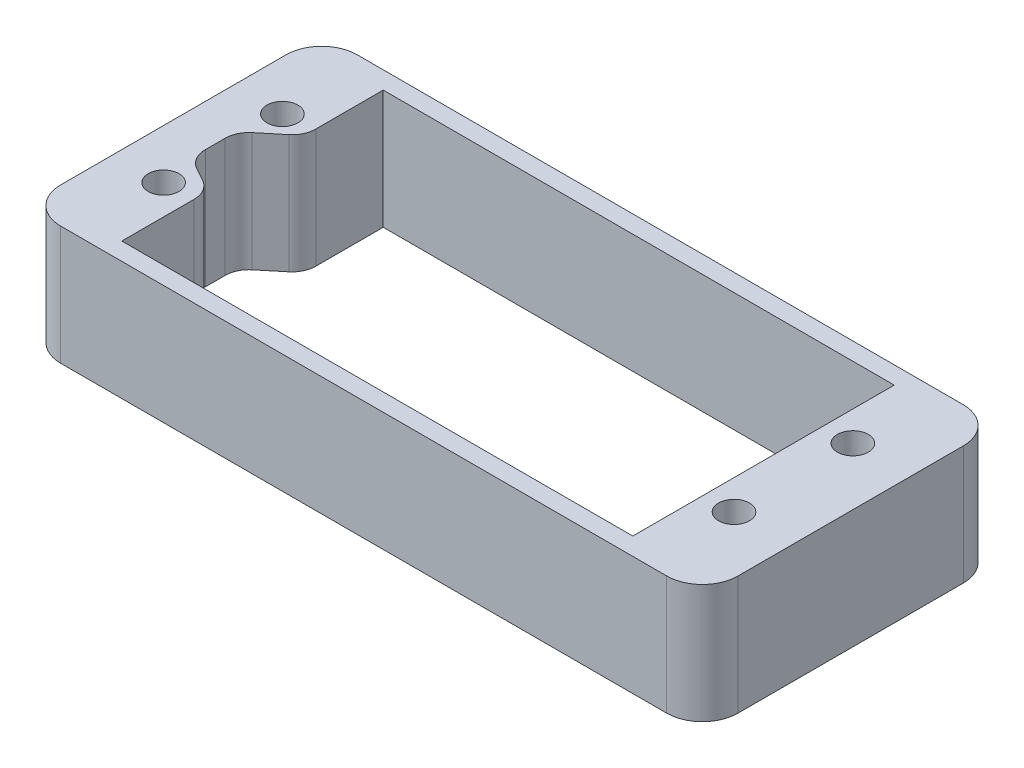
ISO-10303-21;
HEADER;
FILE_DESCRIPTION(('STEP AP214'),'2;1');
FILE_NAME('part.step','',(''),(''),'','','');
FILE_SCHEMA(('AUTOMOTIVE_DESIGN { 1 0 10303 214 1 1 1 1 }'));
ENDSEC;
DATA;
#1=APPLICATION_CONTEXT('core data for automotive mechanical design processes');
#2=APPLICATION_PROTOCOL_DEFINITION('international standard','automotive_design',2000,#1);
#3=PRODUCT_CONTEXT('',#1,'mechanical');
#4=PRODUCT('Part','Part','',(#3));
#5=PRODUCT_RELATED_PRODUCT_CATEGORY('part','',(#4));
#6=PRODUCT_DEFINITION_FORMATION('','',#4);
#7=PRODUCT_DEFINITION_CONTEXT('part definition',#1,'design');
#8=PRODUCT_DEFINITION('design','',#6,#7);
#9=PRODUCT_DEFINITION_SHAPE('','',#8);
#10=(LENGTH_UNIT() NAMED_UNIT(*) SI_UNIT(.MILLI.,.METRE.));
#11=(NAMED_UNIT(*) PLANE_ANGLE_UNIT() SI_UNIT($,.RADIAN.));
#12=(NAMED_UNIT(*) SI_UNIT($,.STERADIAN.) SOLID_ANGLE_UNIT());
#13=UNCERTAINTY_MEASURE_WITH_UNIT(LENGTH_MEASURE(1.E-05),#10,'distance_accuracy_value','');
#14=(GEOMETRIC_REPRESENTATION_CONTEXT(3) GLOBAL_UNCERTAINTY_ASSIGNED_CONTEXT((#13)) GLOBAL_UNIT_ASSIGNED_CONTEXT((#10,
#11,#12)) REPRESENTATION_CONTEXT('',''));
#15=CARTESIAN_POINT('',(0.,0.,0.));
#16=DIRECTION('',(0.,0.,1.));
#17=DIRECTION('',(1.,0.,0.));
#18=AXIS2_PLACEMENT_3D('',#15,#16,#17);
#19=CARTESIAN_POINT('',(-10.6555003551214,28.,-24.4303066538332));
#20=DIRECTION('',(1.,0.,0.));
#21=DIRECTION('',(0.,0.,-1.));
#22=AXIS2_PLACEMENT_3D('',#19,#20,#21);
#23=PLANE('',#22);
#24=DIRECTION('',(0.,0.,-1.));
#25=VECTOR('',#24,1.);
#26=CARTESIAN_POINT('',(-10.6555003551214,10.,-24.4303066538332));
#27=LINE('',#26,#25);
#28=CARTESIAN_POINT('',(-10.6555003551214,10.,-2.4303066538332));
#29=VERTEX_POINT('',#28);
#30=CARTESIAN_POINT('',(-10.6555003551214,10.,-8.50907480389078));
#31=VERTEX_POINT('',#30);
#32=EDGE_CURVE('E197',#29,#31,#27,.T.);
#33=ORIENTED_EDGE('',*,*,#32,.F.);
#34=DIRECTION('',(0.,-1.,0.));
#35=VECTOR('',#34,1.);
#36=CARTESIAN_POINT('',(-10.6555003551214,28.,-2.4303066538332));
#37=LINE('',#36,#35);
#38=CARTESIAN_POINT('',(-10.6555003551214,0.,-2.4303066538332));
#39=VERTEX_POINT('',#38);
#40=EDGE_CURVE('E333',#29,#39,#37,.T.);
#41=ORIENTED_EDGE('',*,*,#40,.T.);
#42=DIRECTION('',(0.,0.,1.));
#43=VECTOR('',#42,1.);
#44=CARTESIAN_POINT('',(-10.6555003551214,0.,-24.4303066538332));
#45=LINE('',#44,#43);
#46=CARTESIAN_POINT('',(-10.6555003551214,0.,-8.50907480389079));
#47=VERTEX_POINT('',#46);
#48=EDGE_CURVE('E315',#47,#39,#45,.T.);
#49=ORIENTED_EDGE('',*,*,#48,.F.);
#50=DIRECTION('',(0.,-1.,0.));
#51=VECTOR('',#50,1.);
#52=CARTESIAN_POINT('',(-10.6555003551214,10.,-8.50907480389078));
#53=LINE('',#52,#51);
#54=EDGE_CURVE('E222',#47,#31,#53,.F.);
#55=ORIENTED_EDGE('',*,*,#54,.T.);
#56=EDGE_LOOP('',(#33,#41,#49,#55));
#57=FACE_BOUND('',#56,.T.);
#58=ADVANCED_FACE('F37',(#57),#23,.T.);
#59=CARTESIAN_POINT('',(0.,0.,0.));
#60=DIRECTION('',(0.,1.,0.));
#61=DIRECTION('',(0.,0.,1.));
#62=AXIS2_PLACEMENT_3D('',#59,#60,#61);
#63=PLANE('',#62);
#64=CARTESIAN_POINT('',(34.8444996448786,0.,-18.4485113559495));
#65=DIRECTION('',(0.,-1.,0.));
#66=DIRECTION('',(0.,0.,-1.));
#67=AXIS2_PLACEMENT_3D('',#64,#65,#66);
#68=CIRCLE('',#67,1.3);
#69=CARTESIAN_POINT('',(34.8444996448786,0.,-19.7485113559495));
#70=VERTEX_POINT('',#69);
#71=EDGE_CURVE('E231',#70,#70,#68,.T.);
#72=ORIENTED_EDGE('',*,*,#71,.F.);
#73=EDGE_LOOP('',(#72));
#74=FACE_BOUND('',#73,.T.);
#75=CARTESIAN_POINT('',(34.8444996448786,0.,-8.44851135594946));
#76=DIRECTION('',(0.,-1.,0.));
#77=DIRECTION('',(0.,0.,-1.));
#78=AXIS2_PLACEMENT_3D('',#75,#76,#77);
#79=CIRCLE('',#78,1.3);
#80=CARTESIAN_POINT('',(34.8444996448786,0.,-9.74851135594947));
#81=VERTEX_POINT('',#80);
#82=EDGE_CURVE('E227',#81,#81,#79,.T.);
#83=ORIENTED_EDGE('',*,*,#82,.F.);
#84=EDGE_LOOP('',(#83));
#85=FACE_BOUND('',#84,.T.);
#86=CARTESIAN_POINT('',(-13.1555003551214,0.,-18.4485113559495));
#87=DIRECTION('',(0.,-1.,0.));
#88=DIRECTION('',(0.,0.,-1.));
#89=AXIS2_PLACEMENT_3D('',#86,#87,#88);
#90=CIRCLE('',#89,1.3);
#91=CARTESIAN_POINT('',(-13.1555003551214,0.,-19.7485113559495));
#92=VERTEX_POINT('',#91);
#93=EDGE_CURVE('E226',#92,#92,#90,.T.);
#94=ORIENTED_EDGE('',*,*,#93,.F.);
#95=EDGE_LOOP('',(#94));
#96=FACE_BOUND('',#95,.T.);
#97=CARTESIAN_POINT('',(-13.1555003551214,0.,-8.44851135594946));
#98=DIRECTION('',(0.,-1.,0.));
#99=DIRECTION('',(0.,0.,-1.));
#100=AXIS2_PLACEMENT_3D('',#97,#98,#99);
#101=CIRCLE('',#100,1.3);
#102=CARTESIAN_POINT('',(-13.1555003551214,0.,-9.74851135594946));
#103=VERTEX_POINT('',#102);
#104=EDGE_CURVE('E304',#103,#103,#101,.T.);
#105=ORIENTED_EDGE('',*,*,#104,.F.);
#106=EDGE_LOOP('',(#105));
#107=FACE_BOUND('',#106,.T.);
#108=DIRECTION('',(0.,0.,1.));
#109=VECTOR('',#108,1.);
#110=CARTESIAN_POINT('',(-17.3180003551214,0.,-25.9079813624971));
#111=LINE('',#110,#109);
#112=CARTESIAN_POINT('',(-17.3180003551214,0.,-22.9079813624971));
#113=VERTEX_POINT('',#112);
#114=CARTESIAN_POINT('',(-17.3180003551214,0.,-3.94851135594946));
#115=VERTEX_POINT('',#114);
#116=EDGE_CURVE('E335',#113,#115,#111,.T.);
#117=ORIENTED_EDGE('',*,*,#116,.F.);
#118=CARTESIAN_POINT('',(-14.3180003551214,0.,-22.9079813624971));
#119=DIRECTION('',(0.,1.,0.));
#120=DIRECTION('',(0.,0.,1.));
#121=AXIS2_PLACEMENT_3D('',#118,#119,#120);
#122=CIRCLE('',#121,3.);
#123=CARTESIAN_POINT('',(-14.3180003551214,0.,-25.9079813624971));
#124=VERTEX_POINT('',#123);
#125=EDGE_CURVE('E209',#113,#124,#122,.F.);
#126=ORIENTED_EDGE('',*,*,#125,.T.);
#127=DIRECTION('',(-1.,0.,0.));
#128=VECTOR('',#127,1.);
#129=CARTESIAN_POINT('',(-17.3180003551214,0.,-25.9079813624971));
#130=LINE('',#129,#128);
#131=CARTESIAN_POINT('',(36.6819996448786,0.,-25.9079813624971));
#132=VERTEX_POINT('',#131);
#133=EDGE_CURVE('E203',#132,#124,#130,.T.);
#134=ORIENTED_EDGE('',*,*,#133,.F.);
#135=CARTESIAN_POINT('',(36.6819996448786,0.,-22.9079813624971));
#136=DIRECTION('',(0.,1.,0.));
#137=DIRECTION('',(0.,0.,1.));
#138=AXIS2_PLACEMENT_3D('',#135,#136,#137);
#139=CIRCLE('',#138,3.);
#140=CARTESIAN_POINT('',(39.6819996448786,0.,-22.9079813624971));
#141=VERTEX_POINT('',#140);
#142=EDGE_CURVE('E353',#132,#141,#139,.F.);
#143=ORIENTED_EDGE('',*,*,#142,.T.);
#144=DIRECTION('',(0.,0.,-1.));
#145=VECTOR('',#144,1.);
#146=CARTESIAN_POINT('',(39.6819996448786,0.,-25.9079813624971));
#147=LINE('',#146,#145);
#148=CARTESIAN_POINT('',(39.6819996448786,0.,-3.94851135594946));
#149=VERTEX_POINT('',#148);
#150=EDGE_CURVE('E341',#149,#141,#147,.T.);
#151=ORIENTED_EDGE('',*,*,#150,.F.);
#152=CARTESIAN_POINT('',(36.6819996448786,0.,-3.94851135594946));
#153=DIRECTION('',(0.,1.,0.));
#154=DIRECTION('',(0.,0.,1.));
#155=AXIS2_PLACEMENT_3D('',#152,#153,#154);
#156=CIRCLE('',#155,3.);
#157=CARTESIAN_POINT('',(36.6819996448786,0.,-0.948511355949463));
#158=VERTEX_POINT('',#157);
#159=EDGE_CURVE('E351',#149,#158,#156,.F.);
#160=ORIENTED_EDGE('',*,*,#159,.T.);
#161=DIRECTION('',(1.,0.,0.));
#162=VECTOR('',#161,1.);
#163=CARTESIAN_POINT('',(-17.3180003551214,0.,-0.948511355949463));
#164=LINE('',#163,#162);
#165=CARTESIAN_POINT('',(-14.3180003551214,0.,-0.948511355949463));
#166=VERTEX_POINT('',#165);
#167=EDGE_CURVE('E338',#166,#158,#164,.T.);
#168=ORIENTED_EDGE('',*,*,#167,.F.);
#169=CARTESIAN_POINT('',(-14.3180003551214,0.,-3.94851135594946));
#170=DIRECTION('',(0.,1.,0.));
#171=DIRECTION('',(0.,0.,1.));
#172=AXIS2_PLACEMENT_3D('',#169,#170,#171);
#173=CIRCLE('',#172,3.);
#174=EDGE_CURVE('E355',#166,#115,#173,.F.);
#175=ORIENTED_EDGE('',*,*,#174,.T.);
#176=EDGE_LOOP('',(#117,#126,#134,#143,#151,#160,#168,#175));
#177=FACE_BOUND('',#176,.T.);
#178=CARTESIAN_POINT('',(-10.6555003551214,0.,-24.4303066538332));
#179=VERTEX_POINT('',#178);
#180=CARTESIAN_POINT('',(-10.6555003551214,0.,-18.7525056788971));
#181=VERTEX_POINT('',#180);
#182=EDGE_CURVE('E316',#179,#181,#45,.T.);
#183=ORIENTED_EDGE('',*,*,#182,.T.);
#184=CARTESIAN_POINT('',(-12.6555003551214,0.,-18.7525056788971));
#185=DIRECTION('',(0.,1.,0.));
#186=DIRECTION('',(0.,0.,1.));
#187=AXIS2_PLACEMENT_3D('',#184,#185,#186);
#188=CIRCLE('',#187,2.);
#189=CARTESIAN_POINT('',(-11.3831337137754,0.,-17.2094298123273));
#190=VERTEX_POINT('',#189);
#191=EDGE_CURVE('E52',#181,#190,#188,.F.);
#192=ORIENTED_EDGE('',*,*,#191,.T.);
#193=DIRECTION('',(0.771537933284871,0.,-0.636183320672988));
#194=VECTOR('',#193,1.);
#195=CARTESIAN_POINT('',(-13.7998502204479,0.,-15.2166895127101));
#196=LINE('',#195,#194);
#197=CARTESIAN_POINT('',(-13.0722168617938,0.,-15.8166706495677));
#198=VERTEX_POINT('',#197);
#199=EDGE_CURVE('E293',#198,#190,#196,.T.);
#200=ORIENTED_EDGE('',*,*,#199,.F.);
#201=CARTESIAN_POINT('',(-11.7998502204479,0.,-14.2735947829979));
#202=DIRECTION('',(0.,1.,0.));
#203=DIRECTION('',(0.,0.,1.));
#204=AXIS2_PLACEMENT_3D('',#201,#202,#203);
#205=CIRCLE('',#204,2.);
#206=CARTESIAN_POINT('',(-13.7998502204479,0.,-14.2735947829979));
#207=VERTEX_POINT('',#206);
#208=EDGE_CURVE('E60',#198,#207,#205,.T.);
#209=ORIENTED_EDGE('',*,*,#208,.T.);
#210=DIRECTION('',(0.,0.,-1.));
#211=VECTOR('',#210,1.);
#212=CARTESIAN_POINT('',(-13.7998502204479,0.,-11.4172199900605));
#213=LINE('',#212,#211);
#214=CARTESIAN_POINT('',(-13.7998502204479,0.,-12.6016282883764));
#215=VERTEX_POINT('',#214);
#216=EDGE_CURVE('E269',#215,#207,#213,.T.);
#217=ORIENTED_EDGE('',*,*,#216,.F.);
#218=CARTESIAN_POINT('',(-11.7998502204479,0.,-12.6016282883764));
#219=DIRECTION('',(0.,1.,0.));
#220=DIRECTION('',(0.,0.,1.));
#221=AXIS2_PLACEMENT_3D('',#218,#219,#220);
#222=CIRCLE('',#221,2.);
#223=CARTESIAN_POINT('',(-12.7612650121783,0.,-10.8478661613358));
#224=VERTEX_POINT('',#223);
#225=EDGE_CURVE('E45',#215,#224,#222,.T.);
#226=ORIENTED_EDGE('',*,*,#225,.T.);
#227=DIRECTION('',(-0.876881063520276,0.,-0.480707395865248));
#228=VECTOR('',#227,1.);
#229=CARTESIAN_POINT('',(-13.7998502204479,0.,-11.4172199900605));
#230=LINE('',#229,#228);
#231=CARTESIAN_POINT('',(-11.6940855633909,0.,-10.2628369309313));
#232=VERTEX_POINT('',#231);
#233=EDGE_CURVE('E267',#232,#224,#230,.T.);
#234=ORIENTED_EDGE('',*,*,#233,.F.);
#235=CARTESIAN_POINT('',(-12.6555003551214,0.,-8.50907480389078));
#236=DIRECTION('',(0.,1.,0.));
#237=DIRECTION('',(0.,0.,1.));
#238=AXIS2_PLACEMENT_3D('',#235,#236,#237);
#239=CIRCLE('',#238,2.);
#240=EDGE_CURVE('E237',#232,#47,#239,.F.);
#241=ORIENTED_EDGE('',*,*,#240,.T.);
#242=ORIENTED_EDGE('',*,*,#48,.T.);
#243=DIRECTION('',(1.,0.,0.));
#244=VECTOR('',#243,1.);
#245=CARTESIAN_POINT('',(-10.6555003551214,0.,-2.4303066538332));
#246=LINE('',#245,#244);
#247=CARTESIAN_POINT('',(32.3444996448786,0.,-2.4303066538332));
#248=VERTEX_POINT('',#247);
#249=EDGE_CURVE('E318',#39,#248,#246,.T.);
#250=ORIENTED_EDGE('',*,*,#249,.T.);
#251=DIRECTION('',(0.,0.,-1.));
#252=VECTOR('',#251,1.);
#253=CARTESIAN_POINT('',(32.3444996448786,0.,-24.4303066538332));
#254=LINE('',#253,#252);
#255=CARTESIAN_POINT('',(32.3444996448786,0.,-24.4303066538332));
#256=VERTEX_POINT('',#255);
#257=EDGE_CURVE('E321',#248,#256,#254,.T.);
#258=ORIENTED_EDGE('',*,*,#257,.T.);
#259=DIRECTION('',(-1.,0.,0.));
#260=VECTOR('',#259,1.);
#261=CARTESIAN_POINT('',(-10.6555003551214,0.,-24.4303066538332));
#262=LINE('',#261,#260);
#263=EDGE_CURVE('E324',#256,#179,#262,.T.);
#264=ORIENTED_EDGE('',*,*,#263,.T.);
#265=EDGE_LOOP('',(#183,#192,#200,#209,#217,#226,#234,#241,#242,#250,#258,#264));
#266=FACE_BOUND('',#265,.T.);
#267=ADVANCED_FACE('F266',(#74,#85,#96,#107,#177,#266),#63,.F.);
#268=CARTESIAN_POINT('',(-17.3180003551214,28.,-25.9079813624971));
#269=DIRECTION('',(1.,0.,0.));
#270=DIRECTION('',(0.,0.,-1.));
#271=AXIS2_PLACEMENT_3D('',#268,#269,#270);
#272=PLANE('',#271);
#273=DIRECTION('',(0.,-1.,0.));
#274=VECTOR('',#273,1.);
#275=CARTESIAN_POINT('',(-17.3180003551214,28.,-3.94851135594946));
#276=LINE('',#275,#274);
#277=CARTESIAN_POINT('',(-17.3180003551214,10.,-3.94851135594946));
#278=VERTEX_POINT('',#277);
#279=EDGE_CURVE('E347',#115,#278,#276,.F.);
#280=ORIENTED_EDGE('',*,*,#279,.T.);
#281=DIRECTION('',(0.,0.,-1.));
#282=VECTOR('',#281,1.);
#283=CARTESIAN_POINT('',(-17.3180003551214,10.,-25.9079813624971));
#284=LINE('',#283,#282);
#285=CARTESIAN_POINT('',(-17.3180003551214,10.,-22.9079813624971));
#286=VERTEX_POINT('',#285);
#287=EDGE_CURVE('E198',#278,#286,#284,.T.);
#288=ORIENTED_EDGE('',*,*,#287,.T.);
#289=DIRECTION('',(0.,-1.,0.));
#290=VECTOR('',#289,1.);
#291=CARTESIAN_POINT('',(-17.3180003551214,28.,-22.9079813624971));
#292=LINE('',#291,#290);
#293=EDGE_CURVE('E196',#286,#113,#292,.T.);
#294=ORIENTED_EDGE('',*,*,#293,.T.);
#295=ORIENTED_EDGE('',*,*,#116,.T.);
#296=EDGE_LOOP('',(#280,#288,#294,#295));
#297=FACE_BOUND('',#296,.T.);
#298=ADVANCED_FACE('F362',(#297),#272,.F.);
#299=CARTESIAN_POINT('',(-17.3180003551214,28.,-0.948511355949463));
#300=DIRECTION('',(0.,0.,-1.));
#301=DIRECTION('',(-1.,0.,0.));
#302=AXIS2_PLACEMENT_3D('',#299,#300,#301);
#303=PLANE('',#302);
#304=DIRECTION('',(1.,0.,0.));
#305=VECTOR('',#304,1.);
#306=CARTESIAN_POINT('',(14.6819996448786,10.,-0.948511355949463));
#307=LINE('',#306,#305);
#308=CARTESIAN_POINT('',(-14.3180003551214,10.,-0.948511355949463));
#309=VERTEX_POINT('',#308);
#310=CARTESIAN_POINT('',(36.6819996448786,10.,-0.948511355949463));
#311=VERTEX_POINT('',#310);
#312=EDGE_CURVE('E188',#309,#311,#307,.T.);
#313=ORIENTED_EDGE('',*,*,#312,.F.);
#314=DIRECTION('',(0.,-1.,0.));
#315=VECTOR('',#314,1.);
#316=CARTESIAN_POINT('',(-14.3180003551214,28.,-0.948511355949463));
#317=LINE('',#316,#315);
#318=EDGE_CURVE('E207',#309,#166,#317,.T.);
#319=ORIENTED_EDGE('',*,*,#318,.T.);
#320=ORIENTED_EDGE('',*,*,#167,.T.);
#321=DIRECTION('',(0.,-1.,0.));
#322=VECTOR('',#321,1.);
#323=CARTESIAN_POINT('',(36.6819996448786,28.,-0.948511355949463));
#324=LINE('',#323,#322);
#325=EDGE_CURVE('E204',#158,#311,#324,.F.);
#326=ORIENTED_EDGE('',*,*,#325,.T.);
#327=EDGE_LOOP('',(#313,#319,#320,#326));
#328=FACE_BOUND('',#327,.T.);
#329=ADVANCED_FACE('F438',(#328),#303,.F.);
#330=CARTESIAN_POINT('',(39.6819996448786,28.,-25.9079813624971));
#331=DIRECTION('',(-1.,0.,0.));
#332=DIRECTION('',(0.,0.,1.));
#333=AXIS2_PLACEMENT_3D('',#330,#331,#332);
#334=PLANE('',#333);
#335=ORIENTED_EDGE('',*,*,#150,.T.);
#336=DIRECTION('',(0.,-1.,0.));
#337=VECTOR('',#336,1.);
#338=CARTESIAN_POINT('',(39.6819996448786,28.,-22.9079813624971));
#339=LINE('',#338,#337);
#340=CARTESIAN_POINT('',(39.6819996448786,10.,-22.9079813624971));
#341=VERTEX_POINT('',#340);
#342=EDGE_CURVE('E217',#141,#341,#339,.F.);
#343=ORIENTED_EDGE('',*,*,#342,.T.);
#344=DIRECTION('',(0.,0.,1.));
#345=VECTOR('',#344,1.);
#346=CARTESIAN_POINT('',(39.6819996448786,10.,-25.9079813624971));
#347=LINE('',#346,#345);
#348=CARTESIAN_POINT('',(39.6819996448786,10.,-3.94851135594946));
#349=VERTEX_POINT('',#348);
#350=EDGE_CURVE('E312',#341,#349,#347,.T.);
#351=ORIENTED_EDGE('',*,*,#350,.T.);
#352=DIRECTION('',(0.,-1.,0.));
#353=VECTOR('',#352,1.);
#354=CARTESIAN_POINT('',(39.6819996448786,28.,-3.94851135594946));
#355=LINE('',#354,#353);
#356=EDGE_CURVE('E214',#349,#149,#355,.T.);
#357=ORIENTED_EDGE('',*,*,#356,.T.);
#358=EDGE_LOOP('',(#335,#343,#351,#357));
#359=FACE_BOUND('',#358,.T.);
#360=ADVANCED_FACE('F433',(#359),#334,.F.);
#361=CARTESIAN_POINT('',(-17.3180003551214,28.,-25.9079813624971));
#362=DIRECTION('',(0.,0.,1.));
#363=DIRECTION('',(1.,0.,0.));
#364=AXIS2_PLACEMENT_3D('',#361,#362,#363);
#365=PLANE('',#364);
#366=DIRECTION('',(0.,-1.,0.));
#367=VECTOR('',#366,1.);
#368=CARTESIAN_POINT('',(-14.3180003551214,28.,-25.9079813624971));
#369=LINE('',#368,#367);
#370=CARTESIAN_POINT('',(-14.3180003551214,10.,-25.9079813624971));
#371=VERTEX_POINT('',#370);
#372=EDGE_CURVE('E195',#124,#371,#369,.F.);
#373=ORIENTED_EDGE('',*,*,#372,.T.);
#374=DIRECTION('',(-1.,0.,0.));
#375=VECTOR('',#374,1.);
#376=CARTESIAN_POINT('',(14.6819996448786,10.,-25.9079813624971));
#377=LINE('',#376,#375);
#378=CARTESIAN_POINT('',(36.6819996448786,10.,-25.9079813624971));
#379=VERTEX_POINT('',#378);
#380=EDGE_CURVE('E174',#379,#371,#377,.T.);
#381=ORIENTED_EDGE('',*,*,#380,.F.);
#382=DIRECTION('',(0.,-1.,0.));
#383=VECTOR('',#382,1.);
#384=CARTESIAN_POINT('',(36.6819996448786,28.,-25.9079813624971));
#385=LINE('',#384,#383);
#386=EDGE_CURVE('E205',#379,#132,#385,.T.);
#387=ORIENTED_EDGE('',*,*,#386,.T.);
#388=ORIENTED_EDGE('',*,*,#133,.T.);
#389=EDGE_LOOP('',(#373,#381,#387,#388));
#390=FACE_BOUND('',#389,.T.);
#391=ADVANCED_FACE('F201',(#390),#365,.F.);
#392=CARTESIAN_POINT('',(-10.6555003551214,10.,-18.7525056788971));
#393=VERTEX_POINT('',#392);
#394=CARTESIAN_POINT('',(-10.6555003551214,10.,-24.4303066538332));
#395=VERTEX_POINT('',#394);
#396=EDGE_CURVE('E278',#393,#395,#27,.T.);
#397=ORIENTED_EDGE('',*,*,#396,.F.);
#398=DIRECTION('',(0.,-1.,0.));
#399=VECTOR('',#398,1.);
#400=CARTESIAN_POINT('',(-10.6555003551214,0.,-18.7525056788971));
#401=LINE('',#400,#399);
#402=EDGE_CURVE('E234',#393,#181,#401,.T.);
#403=ORIENTED_EDGE('',*,*,#402,.T.);
#404=ORIENTED_EDGE('',*,*,#182,.F.);
#405=DIRECTION('',(0.,-1.,0.));
#406=VECTOR('',#405,1.);
#407=CARTESIAN_POINT('',(-10.6555003551214,28.,-24.4303066538332));
#408=LINE('',#407,#406);
#409=EDGE_CURVE('E327',#395,#179,#408,.T.);
#410=ORIENTED_EDGE('',*,*,#409,.F.);
#411=EDGE_LOOP('',(#397,#403,#404,#410));
#412=FACE_BOUND('',#411,.T.);
#413=ADVANCED_FACE('F403',(#412),#23,.T.);
#414=CARTESIAN_POINT('',(-10.6555003551214,28.,-2.4303066538332));
#415=DIRECTION('',(0.,0.,-1.));
#416=DIRECTION('',(-1.,0.,0.));
#417=AXIS2_PLACEMENT_3D('',#414,#415,#416);
#418=PLANE('',#417);
#419=ORIENTED_EDGE('',*,*,#40,.F.);
#420=DIRECTION('',(-1.,0.,0.));
#421=VECTOR('',#420,1.);
#422=CARTESIAN_POINT('',(-10.6555003551214,10.,-2.4303066538332));
#423=LINE('',#422,#421);
#424=CARTESIAN_POINT('',(32.3444996448786,10.,-2.4303066538332));
#425=VERTEX_POINT('',#424);
#426=EDGE_CURVE('E310',#425,#29,#423,.T.);
#427=ORIENTED_EDGE('',*,*,#426,.F.);
#428=DIRECTION('',(0.,-1.,0.));
#429=VECTOR('',#428,1.);
#430=CARTESIAN_POINT('',(32.3444996448786,28.,-2.4303066538332));
#431=LINE('',#430,#429);
#432=EDGE_CURVE('E331',#425,#248,#431,.T.);
#433=ORIENTED_EDGE('',*,*,#432,.T.);
#434=ORIENTED_EDGE('',*,*,#249,.F.);
#435=EDGE_LOOP('',(#419,#427,#433,#434));
#436=FACE_BOUND('',#435,.T.);
#437=ADVANCED_FACE('F391',(#436),#418,.T.);
#438=CARTESIAN_POINT('',(32.3444996448786,28.,-24.4303066538332));
#439=DIRECTION('',(-1.,0.,0.));
#440=DIRECTION('',(0.,0.,1.));
#441=AXIS2_PLACEMENT_3D('',#438,#439,#440);
#442=PLANE('',#441);
#443=DIRECTION('',(0.,0.,1.));
#444=VECTOR('',#443,1.);
#445=CARTESIAN_POINT('',(32.3444996448786,10.,-24.4303066538332));
#446=LINE('',#445,#444);
#447=CARTESIAN_POINT('',(32.3444996448786,10.,-24.4303066538332));
#448=VERTEX_POINT('',#447);
#449=EDGE_CURVE('E187',#448,#425,#446,.T.);
#450=ORIENTED_EDGE('',*,*,#449,.F.);
#451=DIRECTION('',(0.,-1.,0.));
#452=VECTOR('',#451,1.);
#453=CARTESIAN_POINT('',(32.3444996448786,28.,-24.4303066538332));
#454=LINE('',#453,#452);
#455=EDGE_CURVE('E329',#448,#256,#454,.T.);
#456=ORIENTED_EDGE('',*,*,#455,.T.);
#457=ORIENTED_EDGE('',*,*,#257,.F.);
#458=ORIENTED_EDGE('',*,*,#432,.F.);
#459=EDGE_LOOP('',(#450,#456,#457,#458));
#460=FACE_BOUND('',#459,.T.);
#461=ADVANCED_FACE('F396',(#460),#442,.T.);
#462=CARTESIAN_POINT('',(-10.6555003551214,28.,-24.4303066538332));
#463=DIRECTION('',(0.,0.,1.));
#464=DIRECTION('',(1.,0.,0.));
#465=AXIS2_PLACEMENT_3D('',#462,#463,#464);
#466=PLANE('',#465);
#467=DIRECTION('',(1.,0.,0.));
#468=VECTOR('',#467,1.);
#469=CARTESIAN_POINT('',(-10.6555003551214,10.,-24.4303066538332));
#470=LINE('',#469,#468);
#471=EDGE_CURVE('E345',#395,#448,#470,.T.);
#472=ORIENTED_EDGE('',*,*,#471,.F.);
#473=ORIENTED_EDGE('',*,*,#409,.T.);
#474=ORIENTED_EDGE('',*,*,#263,.F.);
#475=ORIENTED_EDGE('',*,*,#455,.F.);
#476=EDGE_LOOP('',(#472,#473,#474,#475));
#477=FACE_BOUND('',#476,.T.);
#478=ADVANCED_FACE('F401',(#477),#466,.T.);
#479=CARTESIAN_POINT('',(14.6819996448786,10.,-60.8654926646327));
#480=DIRECTION('',(0.,-1.,0.));
#481=DIRECTION('',(0.,0.,-1.));
#482=AXIS2_PLACEMENT_3D('',#479,#480,#481);
#483=PLANE('',#482);
#484=ORIENTED_EDGE('',*,*,#396,.T.);
#485=ORIENTED_EDGE('',*,*,#471,.T.);
#486=ORIENTED_EDGE('',*,*,#449,.T.);
#487=ORIENTED_EDGE('',*,*,#426,.T.);
#488=ORIENTED_EDGE('',*,*,#32,.T.);
#489=CARTESIAN_POINT('',(-12.6555003551214,10.,-8.50907480389078));
#490=DIRECTION('',(0.,1.,0.));
#491=DIRECTION('',(0.,0.,1.));
#492=AXIS2_PLACEMENT_3D('',#489,#490,#491);
#493=CIRCLE('',#492,2.);
#494=CARTESIAN_POINT('',(-11.6940855633909,10.,-10.2628369309313));
#495=VERTEX_POINT('',#494);
#496=EDGE_CURVE('E11',#31,#495,#493,.T.);
#497=ORIENTED_EDGE('',*,*,#496,.T.);
#498=DIRECTION('',(-0.876881063520276,0.,-0.480707395865248));
#499=VECTOR('',#498,1.);
#500=CARTESIAN_POINT('',(-13.7998502204479,10.,-11.4172199900605));
#501=LINE('',#500,#499);
#502=CARTESIAN_POINT('',(-12.7612650121783,10.,-10.8478661613358));
#503=VERTEX_POINT('',#502);
#504=EDGE_CURVE('E286',#495,#503,#501,.T.);
#505=ORIENTED_EDGE('',*,*,#504,.T.);
#506=CARTESIAN_POINT('',(-11.7998502204479,10.,-12.6016282883764));
#507=DIRECTION('',(0.,1.,0.));
#508=DIRECTION('',(0.,0.,1.));
#509=AXIS2_PLACEMENT_3D('',#506,#507,#508);
#510=CIRCLE('',#509,2.);
#511=CARTESIAN_POINT('',(-13.7998502204479,10.,-12.6016282883764));
#512=VERTEX_POINT('',#511);
#513=EDGE_CURVE('E251',#503,#512,#510,.F.);
#514=ORIENTED_EDGE('',*,*,#513,.T.);
#515=DIRECTION('',(0.,0.,-1.));
#516=VECTOR('',#515,1.);
#517=CARTESIAN_POINT('',(-13.7998502204479,10.,-11.4172199900605));
#518=LINE('',#517,#516);
#519=CARTESIAN_POINT('',(-13.7998502204479,10.,-14.2735947829979));
#520=VERTEX_POINT('',#519);
#521=EDGE_CURVE('E285',#512,#520,#518,.T.);
#522=ORIENTED_EDGE('',*,*,#521,.T.);
#523=CARTESIAN_POINT('',(-11.7998502204479,10.,-14.2735947829979));
#524=DIRECTION('',(0.,1.,0.));
#525=DIRECTION('',(0.,0.,1.));
#526=AXIS2_PLACEMENT_3D('',#523,#524,#525);
#527=CIRCLE('',#526,2.);
#528=CARTESIAN_POINT('',(-13.0722168617938,10.,-15.8166706495677));
#529=VERTEX_POINT('',#528);
#530=EDGE_CURVE('E253',#520,#529,#527,.F.);
#531=ORIENTED_EDGE('',*,*,#530,.T.);
#532=DIRECTION('',(0.771537933284871,0.,-0.636183320672988));
#533=VECTOR('',#532,1.);
#534=CARTESIAN_POINT('',(-13.7998502204479,10.,-15.2166895127101));
#535=LINE('',#534,#533);
#536=CARTESIAN_POINT('',(-11.3831337137754,10.,-17.2094298123273));
#537=VERTEX_POINT('',#536);
#538=EDGE_CURVE('E290',#529,#537,#535,.T.);
#539=ORIENTED_EDGE('',*,*,#538,.T.);
#540=CARTESIAN_POINT('',(-12.6555003551214,10.,-18.7525056788971));
#541=DIRECTION('',(0.,1.,0.));
#542=DIRECTION('',(0.,0.,1.));
#543=AXIS2_PLACEMENT_3D('',#540,#541,#542);
#544=CIRCLE('',#543,2.);
#545=EDGE_CURVE('E261',#537,#393,#544,.T.);
#546=ORIENTED_EDGE('',*,*,#545,.T.);
#547=EDGE_LOOP('',(#484,#485,#486,#487,#488,#497,#505,#514,#522,#531,#539,#546));
#548=FACE_BOUND('',#547,.T.);
#549=CARTESIAN_POINT('',(34.8444996448786,10.,-18.4485113559495));
#550=DIRECTION('',(0.,-1.,0.));
#551=DIRECTION('',(0.,0.,-1.));
#552=AXIS2_PLACEMENT_3D('',#549,#550,#551);
#553=CIRCLE('',#552,1.3);
#554=CARTESIAN_POINT('',(34.8444996448786,10.,-19.7485113559495));
#555=VERTEX_POINT('',#554);
#556=EDGE_CURVE('E228',#555,#555,#553,.T.);
#557=ORIENTED_EDGE('',*,*,#556,.T.);
#558=EDGE_LOOP('',(#557));
#559=FACE_BOUND('',#558,.T.);
#560=CARTESIAN_POINT('',(34.8444996448786,10.,-8.44851135594946));
#561=DIRECTION('',(0.,-1.,0.));
#562=DIRECTION('',(0.,0.,-1.));
#563=AXIS2_PLACEMENT_3D('',#560,#561,#562);
#564=CIRCLE('',#563,1.3);
#565=CARTESIAN_POINT('',(34.8444996448786,10.,-9.74851135594947));
#566=VERTEX_POINT('',#565);
#567=EDGE_CURVE('E223',#566,#566,#564,.T.);
#568=ORIENTED_EDGE('',*,*,#567,.T.);
#569=EDGE_LOOP('',(#568));
#570=FACE_BOUND('',#569,.T.);
#571=ORIENTED_EDGE('',*,*,#350,.F.);
#572=CARTESIAN_POINT('',(36.6819996448786,10.,-22.9079813624971));
#573=DIRECTION('',(0.,-1.,0.));
#574=DIRECTION('',(0.,0.,-1.));
#575=AXIS2_PLACEMENT_3D('',#572,#573,#574);
#576=CIRCLE('',#575,3.);
#577=EDGE_CURVE('E182',#341,#379,#576,.F.);
#578=ORIENTED_EDGE('',*,*,#577,.T.);
#579=ORIENTED_EDGE('',*,*,#380,.T.);
#580=CARTESIAN_POINT('',(-14.3180003551214,10.,-22.9079813624971));
#581=DIRECTION('',(0.,-1.,0.));
#582=DIRECTION('',(0.,0.,-1.));
#583=AXIS2_PLACEMENT_3D('',#580,#581,#582);
#584=CIRCLE('',#583,3.);
#585=EDGE_CURVE('E179',#371,#286,#584,.F.);
#586=ORIENTED_EDGE('',*,*,#585,.T.);
#587=ORIENTED_EDGE('',*,*,#287,.F.);
#588=CARTESIAN_POINT('',(-14.3180003551214,10.,-3.94851135594946));
#589=DIRECTION('',(0.,-1.,0.));
#590=DIRECTION('',(0.,0.,-1.));
#591=AXIS2_PLACEMENT_3D('',#588,#589,#590);
#592=CIRCLE('',#591,3.);
#593=EDGE_CURVE('E368',#278,#309,#592,.F.);
#594=ORIENTED_EDGE('',*,*,#593,.T.);
#595=ORIENTED_EDGE('',*,*,#312,.T.);
#596=CARTESIAN_POINT('',(36.6819996448786,10.,-3.94851135594946));
#597=DIRECTION('',(0.,-1.,0.));
#598=DIRECTION('',(0.,0.,-1.));
#599=AXIS2_PLACEMENT_3D('',#596,#597,#598);
#600=CIRCLE('',#599,3.);
#601=EDGE_CURVE('E219',#311,#349,#600,.F.);
#602=ORIENTED_EDGE('',*,*,#601,.T.);
#603=EDGE_LOOP('',(#571,#578,#579,#586,#587,#594,#595,#602));
#604=FACE_BOUND('',#603,.T.);
#605=CARTESIAN_POINT('',(-13.1555003551214,10.,-8.44851135594946));
#606=DIRECTION('',(0.,-1.,0.));
#607=DIRECTION('',(0.,0.,-1.));
#608=AXIS2_PLACEMENT_3D('',#605,#606,#607);
#609=CIRCLE('',#608,1.3);
#610=CARTESIAN_POINT('',(-13.1555003551214,10.,-9.74851135594946));
#611=VERTEX_POINT('',#610);
#612=EDGE_CURVE('E369',#611,#611,#609,.F.);
#613=ORIENTED_EDGE('',*,*,#612,.F.);
#614=EDGE_LOOP('',(#613));
#615=FACE_BOUND('',#614,.T.);
#616=CARTESIAN_POINT('',(-13.1555003551214,10.,-18.4485113559495));
#617=DIRECTION('',(0.,-1.,0.));
#618=DIRECTION('',(0.,0.,-1.));
#619=AXIS2_PLACEMENT_3D('',#616,#617,#618);
#620=CIRCLE('',#619,1.3);
#621=CARTESIAN_POINT('',(-13.1555003551214,10.,-19.7485113559495));
#622=VERTEX_POINT('',#621);
#623=EDGE_CURVE('E373',#622,#622,#620,.F.);
#624=ORIENTED_EDGE('',*,*,#623,.F.);
#625=EDGE_LOOP('',(#624));
#626=FACE_BOUND('',#625,.T.);
#627=ADVANCED_FACE('F177',(#548,#559,#570,#604,#615,#626),#483,.F.);
#628=CARTESIAN_POINT('',(-14.3180003551214,28.,-22.9079813624971));
#629=DIRECTION('',(0.,-1.,0.));
#630=DIRECTION('',(0.,0.,-1.));
#631=AXIS2_PLACEMENT_3D('',#628,#629,#630);
#632=CYLINDRICAL_SURFACE('',#631,3.);
#633=ORIENTED_EDGE('',*,*,#585,.F.);
#634=ORIENTED_EDGE('',*,*,#372,.F.);
#635=ORIENTED_EDGE('',*,*,#125,.F.);
#636=ORIENTED_EDGE('',*,*,#293,.F.);
#637=EDGE_LOOP('',(#633,#634,#635,#636));
#638=FACE_BOUND('',#637,.T.);
#639=ADVANCED_FACE('F193',(#638),#632,.T.);
#640=CARTESIAN_POINT('',(-14.3180003551214,28.,-3.94851135594946));
#641=DIRECTION('',(0.,-1.,0.));
#642=DIRECTION('',(0.,0.,-1.));
#643=AXIS2_PLACEMENT_3D('',#640,#641,#642);
#644=CYLINDRICAL_SURFACE('',#643,3.);
#645=ORIENTED_EDGE('',*,*,#593,.F.);
#646=ORIENTED_EDGE('',*,*,#279,.F.);
#647=ORIENTED_EDGE('',*,*,#174,.F.);
#648=ORIENTED_EDGE('',*,*,#318,.F.);
#649=EDGE_LOOP('',(#645,#646,#647,#648));
#650=FACE_BOUND('',#649,.T.);
#651=ADVANCED_FACE('F365',(#650),#644,.T.);
#652=CARTESIAN_POINT('',(36.6819996448786,28.,-22.9079813624971));
#653=DIRECTION('',(0.,-1.,0.));
#654=DIRECTION('',(0.,0.,-1.));
#655=AXIS2_PLACEMENT_3D('',#652,#653,#654);
#656=CYLINDRICAL_SURFACE('',#655,3.);
#657=ORIENTED_EDGE('',*,*,#577,.F.);
#658=ORIENTED_EDGE('',*,*,#342,.F.);
#659=ORIENTED_EDGE('',*,*,#142,.F.);
#660=ORIENTED_EDGE('',*,*,#386,.F.);
#661=EDGE_LOOP('',(#657,#658,#659,#660));
#662=FACE_BOUND('',#661,.T.);
#663=ADVANCED_FACE('F451',(#662),#656,.T.);
#664=CARTESIAN_POINT('',(36.6819996448786,28.,-3.94851135594946));
#665=DIRECTION('',(0.,-1.,0.));
#666=DIRECTION('',(0.,0.,-1.));
#667=AXIS2_PLACEMENT_3D('',#664,#665,#666);
#668=CYLINDRICAL_SURFACE('',#667,3.);
#669=ORIENTED_EDGE('',*,*,#601,.F.);
#670=ORIENTED_EDGE('',*,*,#325,.F.);
#671=ORIENTED_EDGE('',*,*,#159,.F.);
#672=ORIENTED_EDGE('',*,*,#356,.F.);
#673=EDGE_LOOP('',(#669,#670,#671,#672));
#674=FACE_BOUND('',#673,.T.);
#675=ADVANCED_FACE('F454',(#674),#668,.T.);
#676=CARTESIAN_POINT('',(-13.1555003551214,11.,-8.44851135594946));
#677=DIRECTION('',(0.,-1.,0.));
#678=DIRECTION('',(0.,0.,-1.));
#679=AXIS2_PLACEMENT_3D('',#676,#677,#678);
#680=CYLINDRICAL_SURFACE('',#679,1.3);
#681=ORIENTED_EDGE('',*,*,#612,.T.);
#682=EDGE_LOOP('',(#681));
#683=FACE_BOUND('',#682,.T.);
#684=ORIENTED_EDGE('',*,*,#104,.T.);
#685=EDGE_LOOP('',(#684));
#686=FACE_BOUND('',#685,.T.);
#687=ADVANCED_FACE('F457',(#683,#686),#680,.F.);
#688=CARTESIAN_POINT('',(-13.1555003551214,11.,-18.4485113559495));
#689=DIRECTION('',(0.,-1.,0.));
#690=DIRECTION('',(0.,0.,-1.));
#691=AXIS2_PLACEMENT_3D('',#688,#689,#690);
#692=CYLINDRICAL_SURFACE('',#691,1.3);
#693=ORIENTED_EDGE('',*,*,#623,.T.);
#694=EDGE_LOOP('',(#693));
#695=FACE_BOUND('',#694,.T.);
#696=ORIENTED_EDGE('',*,*,#93,.T.);
#697=EDGE_LOOP('',(#696));
#698=FACE_BOUND('',#697,.T.);
#699=ADVANCED_FACE('F462',(#695,#698),#692,.F.);
#700=CARTESIAN_POINT('',(34.8444996448786,11.,-8.44851135594946));
#701=DIRECTION('',(0.,-1.,0.));
#702=DIRECTION('',(0.,0.,-1.));
#703=AXIS2_PLACEMENT_3D('',#700,#701,#702);
#704=CYLINDRICAL_SURFACE('',#703,1.3);
#705=ORIENTED_EDGE('',*,*,#82,.T.);
#706=EDGE_LOOP('',(#705));
#707=FACE_BOUND('',#706,.T.);
#708=ORIENTED_EDGE('',*,*,#567,.F.);
#709=EDGE_LOOP('',(#708));
#710=FACE_BOUND('',#709,.T.);
#711=ADVANCED_FACE('F473',(#707,#710),#704,.F.);
#712=CARTESIAN_POINT('',(34.8444996448786,11.,-18.4485113559495));
#713=DIRECTION('',(0.,-1.,0.));
#714=DIRECTION('',(0.,0.,-1.));
#715=AXIS2_PLACEMENT_3D('',#712,#713,#714);
#716=CYLINDRICAL_SURFACE('',#715,1.3);
#717=ORIENTED_EDGE('',*,*,#71,.T.);
#718=EDGE_LOOP('',(#717));
#719=FACE_BOUND('',#718,.T.);
#720=ORIENTED_EDGE('',*,*,#556,.F.);
#721=EDGE_LOOP('',(#720));
#722=FACE_BOUND('',#721,.T.);
#723=ADVANCED_FACE('F525',(#719,#722),#716,.F.);
#724=CARTESIAN_POINT('',(-13.7998502204479,10.,-11.4172199900605));
#725=DIRECTION('',(-0.480707395865249,0.,0.876881063520277));
#726=DIRECTION('',(0.876881063520277,0.,0.480707395865249));
#727=AXIS2_PLACEMENT_3D('',#724,#725,#726);
#728=PLANE('',#727);
#729=ORIENTED_EDGE('',*,*,#233,.T.);
#730=DIRECTION('',(0.,-1.,0.));
#731=VECTOR('',#730,1.);
#732=CARTESIAN_POINT('',(-12.7612650121783,10.,-10.8478661613358));
#733=LINE('',#732,#731);
#734=EDGE_CURVE('E258',#224,#503,#733,.F.);
#735=ORIENTED_EDGE('',*,*,#734,.T.);
#736=ORIENTED_EDGE('',*,*,#504,.F.);
#737=DIRECTION('',(0.,-1.,0.));
#738=VECTOR('',#737,1.);
#739=CARTESIAN_POINT('',(-11.6940855633909,0.,-10.2628369309313));
#740=LINE('',#739,#738);
#741=EDGE_CURVE('E255',#495,#232,#740,.T.);
#742=ORIENTED_EDGE('',*,*,#741,.T.);
#743=EDGE_LOOP('',(#729,#735,#736,#742));
#744=FACE_BOUND('',#743,.T.);
#745=ADVANCED_FACE('F274',(#744),#728,.F.);
#746=CARTESIAN_POINT('',(-13.7998502204479,10.,-15.2166895127101));
#747=DIRECTION('',(-0.636183320672988,0.,-0.771537933284871));
#748=DIRECTION('',(-0.771537933284871,0.,0.636183320672988));
#749=AXIS2_PLACEMENT_3D('',#746,#747,#748);
#750=PLANE('',#749);
#751=ORIENTED_EDGE('',*,*,#199,.T.);
#752=DIRECTION('',(0.,-1.,0.));
#753=VECTOR('',#752,1.);
#754=CARTESIAN_POINT('',(-11.3831337137754,10.,-17.2094298123273));
#755=LINE('',#754,#753);
#756=EDGE_CURVE('E242',#190,#537,#755,.F.);
#757=ORIENTED_EDGE('',*,*,#756,.T.);
#758=ORIENTED_EDGE('',*,*,#538,.F.);
#759=DIRECTION('',(0.,-1.,0.));
#760=VECTOR('',#759,1.);
#761=CARTESIAN_POINT('',(-13.0722168617938,0.,-15.8166706495677));
#762=LINE('',#761,#760);
#763=EDGE_CURVE('E240',#529,#198,#762,.T.);
#764=ORIENTED_EDGE('',*,*,#763,.T.);
#765=EDGE_LOOP('',(#751,#757,#758,#764));
#766=FACE_BOUND('',#765,.T.);
#767=ADVANCED_FACE('F411',(#766),#750,.F.);
#768=CARTESIAN_POINT('',(-13.7998502204479,10.,-11.4172199900605));
#769=DIRECTION('',(-1.,0.,0.));
#770=DIRECTION('',(0.,0.,1.));
#771=AXIS2_PLACEMENT_3D('',#768,#769,#770);
#772=PLANE('',#771);
#773=ORIENTED_EDGE('',*,*,#216,.T.);
#774=DIRECTION('',(0.,-1.,0.));
#775=VECTOR('',#774,1.);
#776=CARTESIAN_POINT('',(-13.7998502204479,10.,-14.2735947829979));
#777=LINE('',#776,#775);
#778=EDGE_CURVE('E248',#207,#520,#777,.F.);
#779=ORIENTED_EDGE('',*,*,#778,.T.);
#780=ORIENTED_EDGE('',*,*,#521,.F.);
#781=DIRECTION('',(0.,-1.,0.));
#782=VECTOR('',#781,1.);
#783=CARTESIAN_POINT('',(-13.7998502204479,0.,-12.6016282883764));
#784=LINE('',#783,#782);
#785=EDGE_CURVE('E245',#512,#215,#784,.T.);
#786=ORIENTED_EDGE('',*,*,#785,.T.);
#787=EDGE_LOOP('',(#773,#779,#780,#786));
#788=FACE_BOUND('',#787,.T.);
#789=ADVANCED_FACE('F288',(#788),#772,.F.);
#790=CARTESIAN_POINT('',(-12.6555003551214,28.,-18.7525056788971));
#791=DIRECTION('',(0.,1.,0.));
#792=DIRECTION('',(0.,0.,1.));
#793=AXIS2_PLACEMENT_3D('',#790,#791,#792);
#794=CYLINDRICAL_SURFACE('',#793,2.);
#795=ORIENTED_EDGE('',*,*,#545,.F.);
#796=ORIENTED_EDGE('',*,*,#756,.F.);
#797=ORIENTED_EDGE('',*,*,#191,.F.);
#798=ORIENTED_EDGE('',*,*,#402,.F.);
#799=EDGE_LOOP('',(#795,#796,#797,#798));
#800=FACE_BOUND('',#799,.T.);
#801=ADVANCED_FACE('F407',(#800),#794,.T.);
#802=CARTESIAN_POINT('',(-11.7998502204479,10.,-14.2735947829979));
#803=DIRECTION('',(0.,1.,0.));
#804=DIRECTION('',(0.,0.,1.));
#805=AXIS2_PLACEMENT_3D('',#802,#803,#804);
#806=CYLINDRICAL_SURFACE('',#805,2.);
#807=ORIENTED_EDGE('',*,*,#530,.F.);
#808=ORIENTED_EDGE('',*,*,#778,.F.);
#809=ORIENTED_EDGE('',*,*,#208,.F.);
#810=ORIENTED_EDGE('',*,*,#763,.F.);
#811=EDGE_LOOP('',(#807,#808,#809,#810));
#812=FACE_BOUND('',#811,.T.);
#813=ADVANCED_FACE('F412',(#812),#806,.F.);
#814=CARTESIAN_POINT('',(-11.7998502204479,10.,-12.6016282883764));
#815=DIRECTION('',(0.,1.,0.));
#816=DIRECTION('',(0.,0.,1.));
#817=AXIS2_PLACEMENT_3D('',#814,#815,#816);
#818=CYLINDRICAL_SURFACE('',#817,2.);
#819=ORIENTED_EDGE('',*,*,#513,.F.);
#820=ORIENTED_EDGE('',*,*,#734,.F.);
#821=ORIENTED_EDGE('',*,*,#225,.F.);
#822=ORIENTED_EDGE('',*,*,#785,.F.);
#823=EDGE_LOOP('',(#819,#820,#821,#822));
#824=FACE_BOUND('',#823,.T.);
#825=ADVANCED_FACE('F280',(#824),#818,.F.);
#826=CARTESIAN_POINT('',(-12.6555003551214,10.,-8.50907480389078));
#827=DIRECTION('',(0.,1.,0.));
#828=DIRECTION('',(0.,0.,1.));
#829=AXIS2_PLACEMENT_3D('',#826,#827,#828);
#830=CYLINDRICAL_SURFACE('',#829,2.);
#831=ORIENTED_EDGE('',*,*,#496,.F.);
#832=ORIENTED_EDGE('',*,*,#54,.F.);
#833=ORIENTED_EDGE('',*,*,#240,.F.);
#834=ORIENTED_EDGE('',*,*,#741,.F.);
#835=EDGE_LOOP('',(#831,#832,#833,#834));
#836=FACE_BOUND('',#835,.T.);
#837=ADVANCED_FACE('F39',(#836),#830,.T.);
#838=CLOSED_SHELL('',(#58,#267,#298,#329,#360,#391,#413,#437,#461,#478,#627,#639,#651,#663,#675,
#687,#699,#711,#723,#745,#767,#789,#801,#813,#825,#837));
#839=MANIFOLD_SOLID_BREP('B2',#838);
#840=ADVANCED_BREP_SHAPE_REPRESENTATION('',(#18,#839),#14);
#841=SHAPE_DEFINITION_REPRESENTATION(#9,#840);
ENDSEC;
END-ISO-10303-21;
